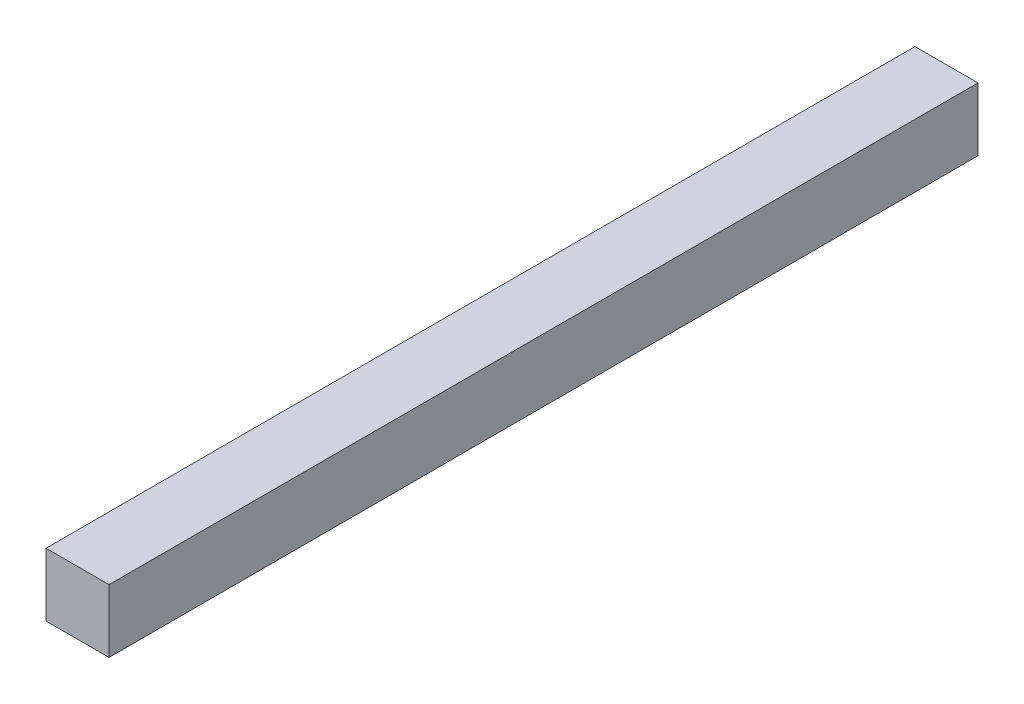
ISO-10303-21;
HEADER;
FILE_DESCRIPTION(('STEP AP214'),'2;1');
FILE_NAME('part.step','',(''),(''),'','','');
FILE_SCHEMA(('AUTOMOTIVE_DESIGN { 1 0 10303 214 1 1 1 1 }'));
ENDSEC;
DATA;
#1=APPLICATION_CONTEXT('core data for automotive mechanical design processes');
#2=APPLICATION_PROTOCOL_DEFINITION('international standard','automotive_design',2000,#1);
#3=PRODUCT_CONTEXT('',#1,'mechanical');
#4=PRODUCT('Part','Part','',(#3));
#5=PRODUCT_RELATED_PRODUCT_CATEGORY('part','',(#4));
#6=PRODUCT_DEFINITION_FORMATION('','',#4);
#7=PRODUCT_DEFINITION_CONTEXT('part definition',#1,'design');
#8=PRODUCT_DEFINITION('design','',#6,#7);
#9=PRODUCT_DEFINITION_SHAPE('','',#8);
#10=(LENGTH_UNIT() NAMED_UNIT(*) SI_UNIT(.MILLI.,.METRE.));
#11=(NAMED_UNIT(*) PLANE_ANGLE_UNIT() SI_UNIT($,.RADIAN.));
#12=(NAMED_UNIT(*) SI_UNIT($,.STERADIAN.) SOLID_ANGLE_UNIT());
#13=UNCERTAINTY_MEASURE_WITH_UNIT(LENGTH_MEASURE(1.E-05),#10,'distance_accuracy_value','');
#14=(GEOMETRIC_REPRESENTATION_CONTEXT(3) GLOBAL_UNCERTAINTY_ASSIGNED_CONTEXT((#13)) GLOBAL_UNIT_ASSIGNED_CONTEXT((#10,
#11,#12)) REPRESENTATION_CONTEXT('',''));
#15=CARTESIAN_POINT('',(0.,0.,0.));
#16=DIRECTION('',(0.,0.,1.));
#17=DIRECTION('',(1.,0.,0.));
#18=AXIS2_PLACEMENT_3D('',#15,#16,#17);
#19=CARTESIAN_POINT('',(0.1994916,0.1994916,0.));
#20=DIRECTION('',(1.,0.,0.));
#21=DIRECTION('',(0.,-1.,0.));
#22=AXIS2_PLACEMENT_3D('',#19,#20,#21);
#23=PLANE('',#22);
#24=DIRECTION('',(0.,0.,1.));
#25=VECTOR('',#24,1.);
#26=CARTESIAN_POINT('',(0.1994916,0.1994916,0.));
#27=LINE('',#26,#25);
#28=CARTESIAN_POINT('',(0.1994916,0.1994916,0.));
#29=VERTEX_POINT('',#28);
#30=CARTESIAN_POINT('',(0.1994916,0.1994916,5.49999916));
#31=VERTEX_POINT('',#30);
#32=EDGE_CURVE('E11',#29,#31,#27,.T.);
#33=ORIENTED_EDGE('',*,*,#32,.T.);
#34=DIRECTION('',(0.,-1.,0.));
#35=VECTOR('',#34,1.);
#36=CARTESIAN_POINT('',(0.1994916,0.1994916,5.49999916));
#37=LINE('',#36,#35);
#38=CARTESIAN_POINT('',(0.1994916,-0.1994916,5.49999916));
#39=VERTEX_POINT('',#38);
#40=EDGE_CURVE('E24',#31,#39,#37,.T.);
#41=ORIENTED_EDGE('',*,*,#40,.T.);
#42=DIRECTION('',(0.,0.,1.));
#43=VECTOR('',#42,1.);
#44=CARTESIAN_POINT('',(0.1994916,-0.1994916,0.));
#45=LINE('',#44,#43);
#46=CARTESIAN_POINT('',(0.1994916,-0.1994916,0.));
#47=VERTEX_POINT('',#46);
#48=EDGE_CURVE('E85',#47,#39,#45,.T.);
#49=ORIENTED_EDGE('',*,*,#48,.F.);
#50=DIRECTION('',(0.,-1.,0.));
#51=VECTOR('',#50,1.);
#52=CARTESIAN_POINT('',(0.1994916,0.1994916,0.));
#53=LINE('',#52,#51);
#54=EDGE_CURVE('E83',#29,#47,#53,.T.);
#55=ORIENTED_EDGE('',*,*,#54,.F.);
#56=EDGE_LOOP('',(#33,#41,#49,#55));
#57=FACE_BOUND('',#56,.T.);
#58=ADVANCED_FACE('F17',(#57),#23,.T.);
#59=CARTESIAN_POINT('',(0.1994916,-0.1994916,0.));
#60=DIRECTION('',(0.,-1.,0.));
#61=DIRECTION('',(-1.,0.,0.));
#62=AXIS2_PLACEMENT_3D('',#59,#60,#61);
#63=PLANE('',#62);
#64=ORIENTED_EDGE('',*,*,#48,.T.);
#65=DIRECTION('',(-1.,0.,0.));
#66=VECTOR('',#65,1.);
#67=CARTESIAN_POINT('',(0.1994916,-0.1994916,5.49999916));
#68=LINE('',#67,#66);
#69=CARTESIAN_POINT('',(-0.1994916,-0.1994916,5.49999916));
#70=VERTEX_POINT('',#69);
#71=EDGE_CURVE('E81',#39,#70,#68,.T.);
#72=ORIENTED_EDGE('',*,*,#71,.T.);
#73=DIRECTION('',(0.,0.,1.));
#74=VECTOR('',#73,1.);
#75=CARTESIAN_POINT('',(-0.1994916,-0.1994916,0.));
#76=LINE('',#75,#74);
#77=CARTESIAN_POINT('',(-0.1994916,-0.1994916,0.));
#78=VERTEX_POINT('',#77);
#79=EDGE_CURVE('E79',#78,#70,#76,.T.);
#80=ORIENTED_EDGE('',*,*,#79,.F.);
#81=DIRECTION('',(-1.,0.,0.));
#82=VECTOR('',#81,1.);
#83=CARTESIAN_POINT('',(0.1994916,-0.1994916,0.));
#84=LINE('',#83,#82);
#85=EDGE_CURVE('E70',#47,#78,#84,.T.);
#86=ORIENTED_EDGE('',*,*,#85,.F.);
#87=EDGE_LOOP('',(#64,#72,#80,#86));
#88=FACE_BOUND('',#87,.T.);
#89=ADVANCED_FACE('F90',(#88),#63,.T.);
#90=CARTESIAN_POINT('',(-0.1994916,-0.1994916,0.));
#91=DIRECTION('',(-0.999999999979736,6.36618282911532E-06,0.));
#92=DIRECTION('',(6.36618282911532E-06,0.999999999979736,0.));
#93=AXIS2_PLACEMENT_3D('',#90,#91,#92);
#94=PLANE('',#93);
#95=ORIENTED_EDGE('',*,*,#79,.T.);
#96=DIRECTION('',(6.36618282911532E-06,0.999999999979736,0.));
#97=VECTOR('',#96,1.);
#98=CARTESIAN_POINT('',(-0.1994916,-0.1994916,5.49999916));
#99=LINE('',#98,#97);
#100=CARTESIAN_POINT('',(-0.19948906,0.1994916,5.49999916));
#101=VERTEX_POINT('',#100);
#102=EDGE_CURVE('E60',#70,#101,#99,.T.);
#103=ORIENTED_EDGE('',*,*,#102,.T.);
#104=DIRECTION('',(0.,0.,1.));
#105=VECTOR('',#104,1.);
#106=CARTESIAN_POINT('',(-0.19948906,0.1994916,0.));
#107=LINE('',#106,#105);
#108=CARTESIAN_POINT('',(-0.19948906,0.1994916,0.));
#109=VERTEX_POINT('',#108);
#110=EDGE_CURVE('E54',#109,#101,#107,.T.);
#111=ORIENTED_EDGE('',*,*,#110,.F.);
#112=DIRECTION('',(6.36618282911532E-06,0.999999999979736,0.));
#113=VECTOR('',#112,1.);
#114=CARTESIAN_POINT('',(-0.1994916,-0.1994916,0.));
#115=LINE('',#114,#113);
#116=EDGE_CURVE('E58',#78,#109,#115,.T.);
#117=ORIENTED_EDGE('',*,*,#116,.F.);
#118=EDGE_LOOP('',(#95,#103,#111,#117));
#119=FACE_BOUND('',#118,.T.);
#120=ADVANCED_FACE('F57',(#119),#94,.T.);
#121=CARTESIAN_POINT('',(-0.19948906,0.1994916,0.));
#122=DIRECTION('',(0.,1.,0.));
#123=DIRECTION('',(1.,0.,0.));
#124=AXIS2_PLACEMENT_3D('',#121,#122,#123);
#125=PLANE('',#124);
#126=ORIENTED_EDGE('',*,*,#110,.T.);
#127=DIRECTION('',(1.,0.,0.));
#128=VECTOR('',#127,1.);
#129=CARTESIAN_POINT('',(-0.19948906,0.1994916,5.49999916));
#130=LINE('',#129,#128);
#131=EDGE_CURVE('E71',#101,#31,#130,.T.);
#132=ORIENTED_EDGE('',*,*,#131,.T.);
#133=ORIENTED_EDGE('',*,*,#32,.F.);
#134=DIRECTION('',(1.,0.,0.));
#135=VECTOR('',#134,1.);
#136=CARTESIAN_POINT('',(-0.19948906,0.1994916,0.));
#137=LINE('',#136,#135);
#138=EDGE_CURVE('E68',#109,#29,#137,.T.);
#139=ORIENTED_EDGE('',*,*,#138,.F.);
#140=EDGE_LOOP('',(#126,#132,#133,#139));
#141=FACE_BOUND('',#140,.T.);
#142=ADVANCED_FACE('F73',(#141),#125,.T.);
#143=CARTESIAN_POINT('',(0.1994916,0.1994916,0.));
#144=DIRECTION('',(0.,0.,1.));
#145=DIRECTION('',(1.,0.,0.));
#146=AXIS2_PLACEMENT_3D('',#143,#144,#145);
#147=PLANE('',#146);
#148=ORIENTED_EDGE('',*,*,#54,.T.);
#149=ORIENTED_EDGE('',*,*,#85,.T.);
#150=ORIENTED_EDGE('',*,*,#116,.T.);
#151=ORIENTED_EDGE('',*,*,#138,.T.);
#152=EDGE_LOOP('',(#148,#149,#150,#151));
#153=FACE_BOUND('',#152,.T.);
#154=ADVANCED_FACE('F67',(#153),#147,.F.);
#155=CARTESIAN_POINT('',(0.1994916,0.1994916,5.49999916));
#156=DIRECTION('',(0.,0.,1.));
#157=DIRECTION('',(1.,0.,0.));
#158=AXIS2_PLACEMENT_3D('',#155,#156,#157);
#159=PLANE('',#158);
#160=ORIENTED_EDGE('',*,*,#131,.F.);
#161=ORIENTED_EDGE('',*,*,#102,.F.);
#162=ORIENTED_EDGE('',*,*,#71,.F.);
#163=ORIENTED_EDGE('',*,*,#40,.F.);
#164=EDGE_LOOP('',(#160,#161,#162,#163));
#165=FACE_BOUND('',#164,.T.);
#166=ADVANCED_FACE('F91',(#165),#159,.T.);
#167=CLOSED_SHELL('',(#58,#89,#120,#142,#154,#166));
#168=MANIFOLD_SOLID_BREP('B1',#167);
#169=ADVANCED_BREP_SHAPE_REPRESENTATION('',(#18,#168),#14);
#170=SHAPE_DEFINITION_REPRESENTATION(#9,#169);
ENDSEC;
END-ISO-10303-21;
